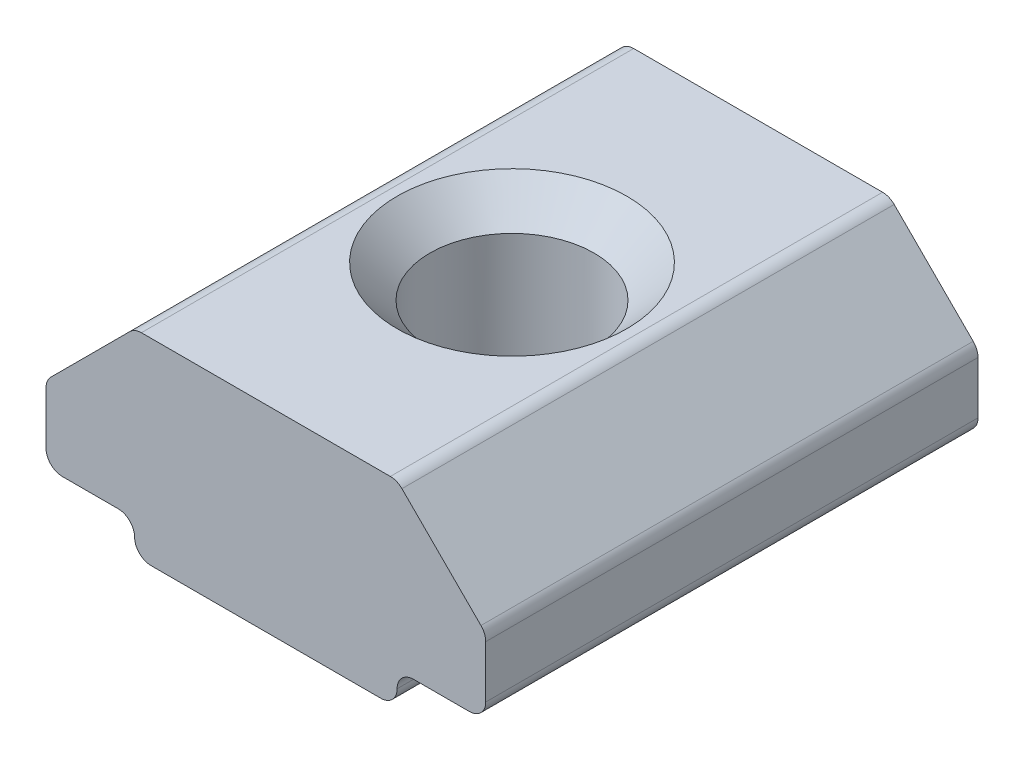
ISO-10303-21;
HEADER;
FILE_DESCRIPTION(('STEP AP214'),'2;1');
FILE_NAME('part.step','',(''),(''),'','','');
FILE_SCHEMA(('AUTOMOTIVE_DESIGN { 1 0 10303 214 1 1 1 1 }'));
ENDSEC;
DATA;
#1=APPLICATION_CONTEXT('core data for automotive mechanical design processes');
#2=APPLICATION_PROTOCOL_DEFINITION('international standard','automotive_design',2000,#1);
#3=PRODUCT_CONTEXT('',#1,'mechanical');
#4=PRODUCT('Part','Part','',(#3));
#5=PRODUCT_RELATED_PRODUCT_CATEGORY('part','',(#4));
#6=PRODUCT_DEFINITION_FORMATION('','',#4);
#7=PRODUCT_DEFINITION_CONTEXT('part definition',#1,'design');
#8=PRODUCT_DEFINITION('design','',#6,#7);
#9=PRODUCT_DEFINITION_SHAPE('','',#8);
#10=(LENGTH_UNIT() NAMED_UNIT(*) SI_UNIT(.MILLI.,.METRE.));
#11=(NAMED_UNIT(*) PLANE_ANGLE_UNIT() SI_UNIT($,.RADIAN.));
#12=(NAMED_UNIT(*) SI_UNIT($,.STERADIAN.) SOLID_ANGLE_UNIT());
#13=UNCERTAINTY_MEASURE_WITH_UNIT(LENGTH_MEASURE(1.E-05),#10,'distance_accuracy_value','');
#14=(GEOMETRIC_REPRESENTATION_CONTEXT(3) GLOBAL_UNCERTAINTY_ASSIGNED_CONTEXT((#13)) GLOBAL_UNIT_ASSIGNED_CONTEXT((#10,
#11,#12)) REPRESENTATION_CONTEXT('',''));
#15=CARTESIAN_POINT('',(0.,0.,0.));
#16=DIRECTION('',(0.,0.,1.));
#17=DIRECTION('',(1.,0.,0.));
#18=AXIS2_PLACEMENT_3D('',#15,#16,#17);
#19=CARTESIAN_POINT('',(-4.,0.,15.));
#20=DIRECTION('',(0.,1.,0.));
#21=DIRECTION('',(0.,0.,1.));
#22=AXIS2_PLACEMENT_3D('',#19,#20,#21);
#23=PLANE('',#22);
#24=DIRECTION('',(1.,0.,0.));
#25=VECTOR('',#24,1.);
#26=CARTESIAN_POINT('',(-4.,0.,0.));
#27=LINE('',#26,#25);
#28=CARTESIAN_POINT('',(-3.5,0.,0.));
#29=VERTEX_POINT('',#28);
#30=CARTESIAN_POINT('',(3.5,0.,0.));
#31=VERTEX_POINT('',#30);
#32=EDGE_CURVE('E268',#29,#31,#27,.T.);
#33=ORIENTED_EDGE('',*,*,#32,.T.);
#34=DIRECTION('',(0.,0.,-1.));
#35=VECTOR('',#34,1.);
#36=CARTESIAN_POINT('',(3.5,0.,15.));
#37=LINE('',#36,#35);
#38=CARTESIAN_POINT('',(3.5,0.,7.5));
#39=VERTEX_POINT('',#38);
#40=EDGE_CURVE('E253',#31,#39,#37,.F.);
#41=ORIENTED_EDGE('',*,*,#40,.T.);
#42=CARTESIAN_POINT('',(0.,0.,7.5));
#43=DIRECTION('',(0.,1.,0.));
#44=DIRECTION('',(0.,0.,1.));
#45=AXIS2_PLACEMENT_3D('',#42,#43,#44);
#46=CIRCLE('',#45,3.5);
#47=CARTESIAN_POINT('',(-3.5,0.,7.5));
#48=VERTEX_POINT('',#47);
#49=EDGE_CURVE('E230',#39,#48,#46,.T.);
#50=ORIENTED_EDGE('',*,*,#49,.T.);
#51=DIRECTION('',(0.,0.,-1.));
#52=VECTOR('',#51,1.);
#53=CARTESIAN_POINT('',(-3.5,0.,15.));
#54=LINE('',#53,#52);
#55=EDGE_CURVE('E246',#48,#29,#54,.T.);
#56=ORIENTED_EDGE('',*,*,#55,.T.);
#57=EDGE_LOOP('',(#33,#41,#50,#56));
#58=FACE_BOUND('',#57,.T.);
#59=ADVANCED_FACE('F16',(#58),#23,.F.);
#60=EDGE_CURVE('E229',#48,#39,#46,.T.);
#61=ORIENTED_EDGE('',*,*,#60,.T.);
#62=DIRECTION('',(0.,0.,-1.));
#63=VECTOR('',#62,1.);
#64=CARTESIAN_POINT('',(3.5,0.,15.));
#65=LINE('',#64,#63);
#66=CARTESIAN_POINT('',(3.5,0.,15.));
#67=VERTEX_POINT('',#66);
#68=EDGE_CURVE('E251',#39,#67,#65,.F.);
#69=ORIENTED_EDGE('',*,*,#68,.T.);
#70=DIRECTION('',(1.,0.,0.));
#71=VECTOR('',#70,1.);
#72=CARTESIAN_POINT('',(-4.,0.,15.));
#73=LINE('',#72,#71);
#74=CARTESIAN_POINT('',(-3.5,0.,15.));
#75=VERTEX_POINT('',#74);
#76=EDGE_CURVE('E173',#75,#67,#73,.T.);
#77=ORIENTED_EDGE('',*,*,#76,.F.);
#78=DIRECTION('',(0.,0.,-1.));
#79=VECTOR('',#78,1.);
#80=CARTESIAN_POINT('',(-3.5,0.,15.));
#81=LINE('',#80,#79);
#82=EDGE_CURVE('E248',#75,#48,#81,.T.);
#83=ORIENTED_EDGE('',*,*,#82,.T.);
#84=EDGE_LOOP('',(#61,#69,#77,#83));
#85=FACE_BOUND('',#84,.T.);
#86=ADVANCED_FACE('F327',(#85),#23,.F.);
#87=CARTESIAN_POINT('',(4.,1.,15.));
#88=DIRECTION('',(0.,1.,0.));
#89=DIRECTION('',(0.,0.,1.));
#90=AXIS2_PLACEMENT_3D('',#87,#88,#89);
#91=PLANE('',#90);
#92=DIRECTION('',(1.,0.,0.));
#93=VECTOR('',#92,1.);
#94=CARTESIAN_POINT('',(4.,1.,15.));
#95=LINE('',#94,#93);
#96=CARTESIAN_POINT('',(4.5,1.,15.));
#97=VERTEX_POINT('',#96);
#98=CARTESIAN_POINT('',(6.2,1.,15.));
#99=VERTEX_POINT('',#98);
#100=EDGE_CURVE('E176',#97,#99,#95,.T.);
#101=ORIENTED_EDGE('',*,*,#100,.F.);
#102=DIRECTION('',(0.,0.,-1.));
#103=VECTOR('',#102,1.);
#104=CARTESIAN_POINT('',(4.5,1.,0.));
#105=LINE('',#104,#103);
#106=CARTESIAN_POINT('',(4.5,1.,0.));
#107=VERTEX_POINT('',#106);
#108=EDGE_CURVE('E259',#97,#107,#105,.T.);
#109=ORIENTED_EDGE('',*,*,#108,.T.);
#110=DIRECTION('',(1.,0.,0.));
#111=VECTOR('',#110,1.);
#112=CARTESIAN_POINT('',(4.,1.,0.));
#113=LINE('',#112,#111);
#114=CARTESIAN_POINT('',(6.2,1.,0.));
#115=VERTEX_POINT('',#114);
#116=EDGE_CURVE('E273',#107,#115,#113,.T.);
#117=ORIENTED_EDGE('',*,*,#116,.T.);
#118=DIRECTION('',(0.,0.,-1.));
#119=VECTOR('',#118,1.);
#120=CARTESIAN_POINT('',(6.2,1.,15.));
#121=LINE('',#120,#119);
#122=EDGE_CURVE('E226',#115,#99,#121,.F.);
#123=ORIENTED_EDGE('',*,*,#122,.T.);
#124=EDGE_LOOP('',(#101,#109,#117,#123));
#125=FACE_BOUND('',#124,.T.);
#126=ADVANCED_FACE('F333',(#125),#91,.F.);
#127=CARTESIAN_POINT('',(6.7,1.,15.));
#128=DIRECTION('',(-1.,0.,0.));
#129=DIRECTION('',(0.,0.,1.));
#130=AXIS2_PLACEMENT_3D('',#127,#128,#129);
#131=PLANE('',#130);
#132=DIRECTION('',(0.,1.,0.));
#133=VECTOR('',#132,1.);
#134=CARTESIAN_POINT('',(6.7,1.,0.));
#135=LINE('',#134,#133);
#136=CARTESIAN_POINT('',(6.7,1.5,0.));
#137=VERTEX_POINT('',#136);
#138=CARTESIAN_POINT('',(6.7,3.09289321881346,0.));
#139=VERTEX_POINT('',#138);
#140=EDGE_CURVE('E293',#137,#139,#135,.T.);
#141=ORIENTED_EDGE('',*,*,#140,.T.);
#142=DIRECTION('',(0.,0.,-1.));
#143=VECTOR('',#142,1.);
#144=CARTESIAN_POINT('',(6.7,3.09289321881346,15.));
#145=LINE('',#144,#143);
#146=CARTESIAN_POINT('',(6.7,3.09289321881346,15.));
#147=VERTEX_POINT('',#146);
#148=EDGE_CURVE('E224',#139,#147,#145,.F.);
#149=ORIENTED_EDGE('',*,*,#148,.T.);
#150=DIRECTION('',(0.,1.,0.));
#151=VECTOR('',#150,1.);
#152=CARTESIAN_POINT('',(6.7,1.,15.));
#153=LINE('',#152,#151);
#154=CARTESIAN_POINT('',(6.7,1.5,15.));
#155=VERTEX_POINT('',#154);
#156=EDGE_CURVE('E547',#155,#147,#153,.T.);
#157=ORIENTED_EDGE('',*,*,#156,.F.);
#158=DIRECTION('',(0.,0.,-1.));
#159=VECTOR('',#158,1.);
#160=CARTESIAN_POINT('',(6.7,1.5,15.));
#161=LINE('',#160,#159);
#162=EDGE_CURVE('E221',#155,#137,#161,.T.);
#163=ORIENTED_EDGE('',*,*,#162,.T.);
#164=EDGE_LOOP('',(#141,#149,#157,#163));
#165=FACE_BOUND('',#164,.T.);
#166=ADVANCED_FACE('F492',(#165),#131,.F.);
#167=CARTESIAN_POINT('',(6.7,3.30000000000001,15.));
#168=DIRECTION('',(-0.707106781186546,-0.707106781186549,0.));
#169=DIRECTION('',(0.707106781186549,-0.707106781186546,0.));
#170=AXIS2_PLACEMENT_3D('',#167,#168,#169);
#171=PLANE('',#170);
#172=DIRECTION('',(-0.707106781186549,0.707106781186546,0.));
#173=VECTOR('',#172,1.);
#174=CARTESIAN_POINT('',(6.7,3.30000000000001,0.));
#175=LINE('',#174,#173);
#176=CARTESIAN_POINT('',(6.55355339059327,3.44644660940674,0.));
#177=VERTEX_POINT('',#176);
#178=CARTESIAN_POINT('',(4.14644660940672,5.85355339059327,0.));
#179=VERTEX_POINT('',#178);
#180=EDGE_CURVE('E296',#177,#179,#175,.T.);
#181=ORIENTED_EDGE('',*,*,#180,.T.);
#182=DIRECTION('',(0.,0.,-1.));
#183=VECTOR('',#182,1.);
#184=CARTESIAN_POINT('',(4.14644660940672,5.85355339059327,15.));
#185=LINE('',#184,#183);
#186=CARTESIAN_POINT('',(4.14644660940672,5.85355339059327,15.));
#187=VERTEX_POINT('',#186);
#188=EDGE_CURVE('E219',#179,#187,#185,.F.);
#189=ORIENTED_EDGE('',*,*,#188,.T.);
#190=DIRECTION('',(-0.707106781186549,0.707106781186546,0.));
#191=VECTOR('',#190,1.);
#192=CARTESIAN_POINT('',(6.7,3.30000000000001,15.));
#193=LINE('',#192,#191);
#194=CARTESIAN_POINT('',(6.55355339059327,3.44644660940674,15.));
#195=VERTEX_POINT('',#194);
#196=EDGE_CURVE('E557',#195,#187,#193,.T.);
#197=ORIENTED_EDGE('',*,*,#196,.F.);
#198=DIRECTION('',(0.,0.,-1.));
#199=VECTOR('',#198,1.);
#200=CARTESIAN_POINT('',(6.55355339059327,3.44644660940674,15.));
#201=LINE('',#200,#199);
#202=EDGE_CURVE('E216',#195,#177,#201,.T.);
#203=ORIENTED_EDGE('',*,*,#202,.T.);
#204=EDGE_LOOP('',(#181,#189,#197,#203));
#205=FACE_BOUND('',#204,.T.);
#206=ADVANCED_FACE('F482',(#205),#171,.F.);
#207=CARTESIAN_POINT('',(4.,6.,15.));
#208=DIRECTION('',(0.,-1.,0.));
#209=DIRECTION('',(0.,0.,-1.));
#210=AXIS2_PLACEMENT_3D('',#207,#208,#209);
#211=PLANE('',#210);
#212=CARTESIAN_POINT('',(0.,6.,7.5));
#213=DIRECTION('',(0.,-1.,0.));
#214=DIRECTION('',(0.,0.,-1.));
#215=AXIS2_PLACEMENT_3D('',#212,#213,#214);
#216=CIRCLE('',#215,3.50000000000001);
#217=CARTESIAN_POINT('',(0.,6.,3.99999999999999));
#218=VERTEX_POINT('',#217);
#219=EDGE_CURVE('E239',#218,#218,#216,.T.);
#220=ORIENTED_EDGE('',*,*,#219,.T.);
#221=EDGE_LOOP('',(#220));
#222=FACE_BOUND('',#221,.T.);
#223=DIRECTION('',(-1.,0.,0.));
#224=VECTOR('',#223,1.);
#225=CARTESIAN_POINT('',(4.,6.,0.));
#226=LINE('',#225,#224);
#227=CARTESIAN_POINT('',(3.79289321881345,6.,0.));
#228=VERTEX_POINT('',#227);
#229=CARTESIAN_POINT('',(-3.79289321881345,6.,0.));
#230=VERTEX_POINT('',#229);
#231=EDGE_CURVE('E299',#228,#230,#226,.T.);
#232=ORIENTED_EDGE('',*,*,#231,.T.);
#233=DIRECTION('',(0.,0.,-1.));
#234=VECTOR('',#233,1.);
#235=CARTESIAN_POINT('',(-3.79289321881345,6.,15.));
#236=LINE('',#235,#234);
#237=CARTESIAN_POINT('',(-3.79289321881345,6.,15.));
#238=VERTEX_POINT('',#237);
#239=EDGE_CURVE('E214',#230,#238,#236,.F.);
#240=ORIENTED_EDGE('',*,*,#239,.T.);
#241=DIRECTION('',(-1.,0.,0.));
#242=VECTOR('',#241,1.);
#243=CARTESIAN_POINT('',(4.,6.,15.));
#244=LINE('',#243,#242);
#245=CARTESIAN_POINT('',(3.79289321881345,6.,15.));
#246=VERTEX_POINT('',#245);
#247=EDGE_CURVE('E560',#246,#238,#244,.T.);
#248=ORIENTED_EDGE('',*,*,#247,.F.);
#249=DIRECTION('',(0.,0.,-1.));
#250=VECTOR('',#249,1.);
#251=CARTESIAN_POINT('',(3.79289321881345,6.,15.));
#252=LINE('',#251,#250);
#253=EDGE_CURVE('E211',#246,#228,#252,.T.);
#254=ORIENTED_EDGE('',*,*,#253,.T.);
#255=EDGE_LOOP('',(#232,#240,#248,#254));
#256=FACE_BOUND('',#255,.T.);
#257=ADVANCED_FACE('F324',(#222,#256),#211,.F.);
#258=CARTESIAN_POINT('',(-6.7,3.30000000000001,15.));
#259=DIRECTION('',(0.707106781186546,-0.707106781186549,0.));
#260=DIRECTION('',(0.707106781186549,0.707106781186546,0.));
#261=AXIS2_PLACEMENT_3D('',#258,#259,#260);
#262=PLANE('',#261);
#263=DIRECTION('',(-0.707106781186549,-0.707106781186546,0.));
#264=VECTOR('',#263,1.);
#265=CARTESIAN_POINT('',(-6.7,3.30000000000001,0.));
#266=LINE('',#265,#264);
#267=CARTESIAN_POINT('',(-4.14644660940673,5.85355339059327,0.));
#268=VERTEX_POINT('',#267);
#269=CARTESIAN_POINT('',(-6.55355339059327,3.44644660940673,0.));
#270=VERTEX_POINT('',#269);
#271=EDGE_CURVE('E178',#268,#270,#266,.T.);
#272=ORIENTED_EDGE('',*,*,#271,.T.);
#273=DIRECTION('',(0.,0.,-1.));
#274=VECTOR('',#273,1.);
#275=CARTESIAN_POINT('',(-6.55355339059327,3.44644660940673,15.));
#276=LINE('',#275,#274);
#277=CARTESIAN_POINT('',(-6.55355339059327,3.44644660940673,15.));
#278=VERTEX_POINT('',#277);
#279=EDGE_CURVE('E209',#270,#278,#276,.F.);
#280=ORIENTED_EDGE('',*,*,#279,.T.);
#281=DIRECTION('',(-0.707106781186549,-0.707106781186546,0.));
#282=VECTOR('',#281,1.);
#283=CARTESIAN_POINT('',(-6.7,3.30000000000001,15.));
#284=LINE('',#283,#282);
#285=CARTESIAN_POINT('',(-4.14644660940673,5.85355339059327,15.));
#286=VERTEX_POINT('',#285);
#287=EDGE_CURVE('E288',#286,#278,#284,.T.);
#288=ORIENTED_EDGE('',*,*,#287,.F.);
#289=DIRECTION('',(0.,0.,-1.));
#290=VECTOR('',#289,1.);
#291=CARTESIAN_POINT('',(-4.14644660940673,5.85355339059327,15.));
#292=LINE('',#291,#290);
#293=EDGE_CURVE('E206',#286,#268,#292,.T.);
#294=ORIENTED_EDGE('',*,*,#293,.T.);
#295=EDGE_LOOP('',(#272,#280,#288,#294));
#296=FACE_BOUND('',#295,.T.);
#297=ADVANCED_FACE('F305',(#296),#262,.F.);
#298=CARTESIAN_POINT('',(-6.7,1.,15.));
#299=DIRECTION('',(1.,0.,0.));
#300=DIRECTION('',(0.,0.,-1.));
#301=AXIS2_PLACEMENT_3D('',#298,#299,#300);
#302=PLANE('',#301);
#303=DIRECTION('',(0.,-1.,0.));
#304=VECTOR('',#303,1.);
#305=CARTESIAN_POINT('',(-6.7,1.,0.));
#306=LINE('',#305,#304);
#307=CARTESIAN_POINT('',(-6.7,3.09289321881346,0.));
#308=VERTEX_POINT('',#307);
#309=CARTESIAN_POINT('',(-6.7,1.5,0.));
#310=VERTEX_POINT('',#309);
#311=EDGE_CURVE('E174',#308,#310,#306,.T.);
#312=ORIENTED_EDGE('',*,*,#311,.T.);
#313=DIRECTION('',(0.,0.,-1.));
#314=VECTOR('',#313,1.);
#315=CARTESIAN_POINT('',(-6.7,1.5,15.));
#316=LINE('',#315,#314);
#317=CARTESIAN_POINT('',(-6.7,1.5,15.));
#318=VERTEX_POINT('',#317);
#319=EDGE_CURVE('E152',#310,#318,#316,.F.);
#320=ORIENTED_EDGE('',*,*,#319,.T.);
#321=DIRECTION('',(0.,-1.,0.));
#322=VECTOR('',#321,1.);
#323=CARTESIAN_POINT('',(-6.7,1.,15.));
#324=LINE('',#323,#322);
#325=CARTESIAN_POINT('',(-6.7,3.09289321881346,15.));
#326=VERTEX_POINT('',#325);
#327=EDGE_CURVE('E286',#326,#318,#324,.T.);
#328=ORIENTED_EDGE('',*,*,#327,.F.);
#329=DIRECTION('',(0.,0.,-1.));
#330=VECTOR('',#329,1.);
#331=CARTESIAN_POINT('',(-6.7,3.09289321881346,15.));
#332=LINE('',#331,#330);
#333=EDGE_CURVE('E157',#326,#308,#332,.T.);
#334=ORIENTED_EDGE('',*,*,#333,.T.);
#335=EDGE_LOOP('',(#312,#320,#328,#334));
#336=FACE_BOUND('',#335,.T.);
#337=ADVANCED_FACE('F315',(#336),#302,.F.);
#338=CARTESIAN_POINT('',(-6.7,1.,15.));
#339=DIRECTION('',(0.,1.,0.));
#340=DIRECTION('',(0.,0.,1.));
#341=AXIS2_PLACEMENT_3D('',#338,#339,#340);
#342=PLANE('',#341);
#343=DIRECTION('',(1.,0.,0.));
#344=VECTOR('',#343,1.);
#345=CARTESIAN_POINT('',(-6.7,1.,0.));
#346=LINE('',#345,#344);
#347=CARTESIAN_POINT('',(-6.2,1.,0.));
#348=VERTEX_POINT('',#347);
#349=CARTESIAN_POINT('',(-4.5,1.,0.));
#350=VERTEX_POINT('',#349);
#351=EDGE_CURVE('E164',#348,#350,#346,.T.);
#352=ORIENTED_EDGE('',*,*,#351,.T.);
#353=DIRECTION('',(0.,0.,-1.));
#354=VECTOR('',#353,1.);
#355=CARTESIAN_POINT('',(-4.5,1.,15.));
#356=LINE('',#355,#354);
#357=CARTESIAN_POINT('',(-4.5,1.,15.));
#358=VERTEX_POINT('',#357);
#359=EDGE_CURVE('E261',#350,#358,#356,.F.);
#360=ORIENTED_EDGE('',*,*,#359,.T.);
#361=DIRECTION('',(1.,0.,0.));
#362=VECTOR('',#361,1.);
#363=CARTESIAN_POINT('',(-6.7,1.,15.));
#364=LINE('',#363,#362);
#365=CARTESIAN_POINT('',(-6.2,1.,15.));
#366=VERTEX_POINT('',#365);
#367=EDGE_CURVE('E167',#366,#358,#364,.T.);
#368=ORIENTED_EDGE('',*,*,#367,.F.);
#369=DIRECTION('',(0.,0.,-1.));
#370=VECTOR('',#369,1.);
#371=CARTESIAN_POINT('',(-6.2,1.,15.));
#372=LINE('',#371,#370);
#373=EDGE_CURVE('E151',#366,#348,#372,.T.);
#374=ORIENTED_EDGE('',*,*,#373,.T.);
#375=EDGE_LOOP('',(#352,#360,#368,#374));
#376=FACE_BOUND('',#375,.T.);
#377=ADVANCED_FACE('F163',(#376),#342,.F.);
#378=CARTESIAN_POINT('',(0.,0.,15.));
#379=DIRECTION('',(0.,0.,1.));
#380=DIRECTION('',(1.,0.,0.));
#381=AXIS2_PLACEMENT_3D('',#378,#379,#380);
#382=PLANE('',#381);
#383=ORIENTED_EDGE('',*,*,#76,.T.);
#384=CARTESIAN_POINT('',(3.5,0.5,15.));
#385=DIRECTION('',(0.,0.,1.));
#386=DIRECTION('',(1.,0.,0.));
#387=AXIS2_PLACEMENT_3D('',#384,#385,#386);
#388=CIRCLE('',#387,0.5);
#389=CARTESIAN_POINT('',(4.,0.5,15.));
#390=VERTEX_POINT('',#389);
#391=EDGE_CURVE('E38',#67,#390,#388,.T.);
#392=ORIENTED_EDGE('',*,*,#391,.T.);
#393=CARTESIAN_POINT('',(4.5,0.5,15.));
#394=DIRECTION('',(0.,0.,1.));
#395=DIRECTION('',(1.,0.,0.));
#396=AXIS2_PLACEMENT_3D('',#393,#394,#395);
#397=CIRCLE('',#396,0.5);
#398=EDGE_CURVE('E33',#390,#97,#397,.F.);
#399=ORIENTED_EDGE('',*,*,#398,.T.);
#400=ORIENTED_EDGE('',*,*,#100,.T.);
#401=CARTESIAN_POINT('',(6.2,1.5,15.));
#402=DIRECTION('',(0.,0.,1.));
#403=DIRECTION('',(1.,0.,0.));
#404=AXIS2_PLACEMENT_3D('',#401,#402,#403);
#405=CIRCLE('',#404,0.5);
#406=EDGE_CURVE('E194',#99,#155,#405,.T.);
#407=ORIENTED_EDGE('',*,*,#406,.T.);
#408=ORIENTED_EDGE('',*,*,#156,.T.);
#409=CARTESIAN_POINT('',(6.2,3.09289321881346,15.));
#410=DIRECTION('',(0.,0.,1.));
#411=DIRECTION('',(1.,0.,0.));
#412=AXIS2_PLACEMENT_3D('',#409,#410,#411);
#413=CIRCLE('',#412,0.5);
#414=EDGE_CURVE('E196',#147,#195,#413,.T.);
#415=ORIENTED_EDGE('',*,*,#414,.T.);
#416=ORIENTED_EDGE('',*,*,#196,.T.);
#417=CARTESIAN_POINT('',(3.79289321881345,5.5,15.));
#418=DIRECTION('',(0.,0.,1.));
#419=DIRECTION('',(1.,0.,0.));
#420=AXIS2_PLACEMENT_3D('',#417,#418,#419);
#421=CIRCLE('',#420,0.5);
#422=EDGE_CURVE('E198',#187,#246,#421,.T.);
#423=ORIENTED_EDGE('',*,*,#422,.T.);
#424=ORIENTED_EDGE('',*,*,#247,.T.);
#425=CARTESIAN_POINT('',(-3.79289321881345,5.5,15.));
#426=DIRECTION('',(0.,0.,1.));
#427=DIRECTION('',(1.,0.,0.));
#428=AXIS2_PLACEMENT_3D('',#425,#426,#427);
#429=CIRCLE('',#428,0.5);
#430=EDGE_CURVE('E200',#238,#286,#429,.T.);
#431=ORIENTED_EDGE('',*,*,#430,.T.);
#432=ORIENTED_EDGE('',*,*,#287,.T.);
#433=CARTESIAN_POINT('',(-6.2,3.09289321881346,15.));
#434=DIRECTION('',(0.,0.,1.));
#435=DIRECTION('',(1.,0.,0.));
#436=AXIS2_PLACEMENT_3D('',#433,#434,#435);
#437=CIRCLE('',#436,0.5);
#438=EDGE_CURVE('E202',#278,#326,#437,.T.);
#439=ORIENTED_EDGE('',*,*,#438,.T.);
#440=ORIENTED_EDGE('',*,*,#327,.T.);
#441=CARTESIAN_POINT('',(-6.2,1.5,15.));
#442=DIRECTION('',(0.,0.,1.));
#443=DIRECTION('',(1.,0.,0.));
#444=AXIS2_PLACEMENT_3D('',#441,#442,#443);
#445=CIRCLE('',#444,0.5);
#446=EDGE_CURVE('E204',#318,#366,#445,.T.);
#447=ORIENTED_EDGE('',*,*,#446,.T.);
#448=ORIENTED_EDGE('',*,*,#367,.T.);
#449=CARTESIAN_POINT('',(-4.5,0.5,15.));
#450=DIRECTION('',(0.,0.,1.));
#451=DIRECTION('',(1.,0.,0.));
#452=AXIS2_PLACEMENT_3D('',#449,#450,#451);
#453=CIRCLE('',#452,0.5);
#454=CARTESIAN_POINT('',(-4.,0.5,15.));
#455=VERTEX_POINT('',#454);
#456=EDGE_CURVE('E10',#358,#455,#453,.F.);
#457=ORIENTED_EDGE('',*,*,#456,.T.);
#458=CARTESIAN_POINT('',(-3.5,0.5,15.));
#459=DIRECTION('',(0.,0.,1.));
#460=DIRECTION('',(1.,0.,0.));
#461=AXIS2_PLACEMENT_3D('',#458,#459,#460);
#462=CIRCLE('',#461,0.5);
#463=EDGE_CURVE('E256',#455,#75,#462,.T.);
#464=ORIENTED_EDGE('',*,*,#463,.T.);
#465=EDGE_LOOP('',(#383,#392,#399,#400,#407,#408,#415,#416,#423,#424,#431,#432,#439,#440,#447,
#448,#457,#464));
#466=FACE_BOUND('',#465,.T.);
#467=ADVANCED_FACE('F284',(#466),#382,.T.);
#468=CARTESIAN_POINT('',(0.,0.,0.));
#469=DIRECTION('',(0.,0.,1.));
#470=DIRECTION('',(1.,0.,0.));
#471=AXIS2_PLACEMENT_3D('',#468,#469,#470);
#472=PLANE('',#471);
#473=ORIENTED_EDGE('',*,*,#116,.F.);
#474=CARTESIAN_POINT('',(4.5,0.5,0.));
#475=DIRECTION('',(0.,0.,1.));
#476=DIRECTION('',(1.,0.,0.));
#477=AXIS2_PLACEMENT_3D('',#474,#475,#476);
#478=CIRCLE('',#477,0.5);
#479=CARTESIAN_POINT('',(4.,0.5,0.));
#480=VERTEX_POINT('',#479);
#481=EDGE_CURVE('E263',#107,#480,#478,.T.);
#482=ORIENTED_EDGE('',*,*,#481,.T.);
#483=CARTESIAN_POINT('',(3.5,0.5,0.));
#484=DIRECTION('',(0.,0.,1.));
#485=DIRECTION('',(1.,0.,0.));
#486=AXIS2_PLACEMENT_3D('',#483,#484,#485);
#487=CIRCLE('',#486,0.5);
#488=EDGE_CURVE('E244',#480,#31,#487,.F.);
#489=ORIENTED_EDGE('',*,*,#488,.T.);
#490=ORIENTED_EDGE('',*,*,#32,.F.);
#491=CARTESIAN_POINT('',(-3.5,0.5,0.));
#492=DIRECTION('',(0.,0.,1.));
#493=DIRECTION('',(1.,0.,0.));
#494=AXIS2_PLACEMENT_3D('',#491,#492,#493);
#495=CIRCLE('',#494,0.5);
#496=CARTESIAN_POINT('',(-4.,0.5,0.));
#497=VERTEX_POINT('',#496);
#498=EDGE_CURVE('E242',#29,#497,#495,.F.);
#499=ORIENTED_EDGE('',*,*,#498,.T.);
#500=CARTESIAN_POINT('',(-4.5,0.5,0.));
#501=DIRECTION('',(0.,0.,1.));
#502=DIRECTION('',(1.,0.,0.));
#503=AXIS2_PLACEMENT_3D('',#500,#501,#502);
#504=CIRCLE('',#503,0.5);
#505=EDGE_CURVE('E25',#497,#350,#504,.T.);
#506=ORIENTED_EDGE('',*,*,#505,.T.);
#507=ORIENTED_EDGE('',*,*,#351,.F.);
#508=CARTESIAN_POINT('',(-6.2,1.5,0.));
#509=DIRECTION('',(0.,0.,1.));
#510=DIRECTION('',(1.,0.,0.));
#511=AXIS2_PLACEMENT_3D('',#508,#509,#510);
#512=CIRCLE('',#511,0.5);
#513=EDGE_CURVE('E147',#348,#310,#512,.F.);
#514=ORIENTED_EDGE('',*,*,#513,.T.);
#515=ORIENTED_EDGE('',*,*,#311,.F.);
#516=CARTESIAN_POINT('',(-6.2,3.09289321881346,0.));
#517=DIRECTION('',(0.,0.,1.));
#518=DIRECTION('',(1.,0.,0.));
#519=AXIS2_PLACEMENT_3D('',#516,#517,#518);
#520=CIRCLE('',#519,0.5);
#521=EDGE_CURVE('E158',#308,#270,#520,.F.);
#522=ORIENTED_EDGE('',*,*,#521,.T.);
#523=ORIENTED_EDGE('',*,*,#271,.F.);
#524=CARTESIAN_POINT('',(-3.79289321881345,5.5,0.));
#525=DIRECTION('',(0.,0.,1.));
#526=DIRECTION('',(1.,0.,0.));
#527=AXIS2_PLACEMENT_3D('',#524,#525,#526);
#528=CIRCLE('',#527,0.5);
#529=EDGE_CURVE('E188',#268,#230,#528,.F.);
#530=ORIENTED_EDGE('',*,*,#529,.T.);
#531=ORIENTED_EDGE('',*,*,#231,.F.);
#532=CARTESIAN_POINT('',(3.79289321881345,5.5,0.));
#533=DIRECTION('',(0.,0.,1.));
#534=DIRECTION('',(1.,0.,0.));
#535=AXIS2_PLACEMENT_3D('',#532,#533,#534);
#536=CIRCLE('',#535,0.5);
#537=EDGE_CURVE('E186',#228,#179,#536,.F.);
#538=ORIENTED_EDGE('',*,*,#537,.T.);
#539=ORIENTED_EDGE('',*,*,#180,.F.);
#540=CARTESIAN_POINT('',(6.2,3.09289321881346,0.));
#541=DIRECTION('',(0.,0.,1.));
#542=DIRECTION('',(1.,0.,0.));
#543=AXIS2_PLACEMENT_3D('',#540,#541,#542);
#544=CIRCLE('',#543,0.5);
#545=EDGE_CURVE('E184',#177,#139,#544,.F.);
#546=ORIENTED_EDGE('',*,*,#545,.T.);
#547=ORIENTED_EDGE('',*,*,#140,.F.);
#548=CARTESIAN_POINT('',(6.2,1.5,0.));
#549=DIRECTION('',(0.,0.,1.));
#550=DIRECTION('',(1.,0.,0.));
#551=AXIS2_PLACEMENT_3D('',#548,#549,#550);
#552=CIRCLE('',#551,0.5);
#553=EDGE_CURVE('E168',#137,#115,#552,.F.);
#554=ORIENTED_EDGE('',*,*,#553,.T.);
#555=EDGE_LOOP('',(#473,#482,#489,#490,#499,#506,#507,#514,#515,#522,#523,#530,#531,#538,#539,
#546,#547,#554));
#556=FACE_BOUND('',#555,.T.);
#557=ADVANCED_FACE('F171',(#556),#472,.F.);
#558=CARTESIAN_POINT('',(-6.2,1.5,15.));
#559=DIRECTION('',(0.,0.,-1.));
#560=DIRECTION('',(-1.,0.,0.));
#561=AXIS2_PLACEMENT_3D('',#558,#559,#560);
#562=CYLINDRICAL_SURFACE('',#561,0.5);
#563=ORIENTED_EDGE('',*,*,#446,.F.);
#564=ORIENTED_EDGE('',*,*,#319,.F.);
#565=ORIENTED_EDGE('',*,*,#513,.F.);
#566=ORIENTED_EDGE('',*,*,#373,.F.);
#567=EDGE_LOOP('',(#563,#564,#565,#566));
#568=FACE_BOUND('',#567,.T.);
#569=ADVANCED_FACE('F150',(#568),#562,.T.);
#570=CARTESIAN_POINT('',(-6.2,3.09289321881346,15.));
#571=DIRECTION('',(0.,0.,-1.));
#572=DIRECTION('',(-1.,0.,0.));
#573=AXIS2_PLACEMENT_3D('',#570,#571,#572);
#574=CYLINDRICAL_SURFACE('',#573,0.5);
#575=ORIENTED_EDGE('',*,*,#438,.F.);
#576=ORIENTED_EDGE('',*,*,#279,.F.);
#577=ORIENTED_EDGE('',*,*,#521,.F.);
#578=ORIENTED_EDGE('',*,*,#333,.F.);
#579=EDGE_LOOP('',(#575,#576,#577,#578));
#580=FACE_BOUND('',#579,.T.);
#581=ADVANCED_FACE('F311',(#580),#574,.T.);
#582=CARTESIAN_POINT('',(-3.79289321881345,5.5,15.));
#583=DIRECTION('',(0.,0.,-1.));
#584=DIRECTION('',(-1.,0.,0.));
#585=AXIS2_PLACEMENT_3D('',#582,#583,#584);
#586=CYLINDRICAL_SURFACE('',#585,0.5);
#587=ORIENTED_EDGE('',*,*,#430,.F.);
#588=ORIENTED_EDGE('',*,*,#239,.F.);
#589=ORIENTED_EDGE('',*,*,#529,.F.);
#590=ORIENTED_EDGE('',*,*,#293,.F.);
#591=EDGE_LOOP('',(#587,#588,#589,#590));
#592=FACE_BOUND('',#591,.T.);
#593=ADVANCED_FACE('F342',(#592),#586,.T.);
#594=CARTESIAN_POINT('',(3.79289321881345,5.5,15.));
#595=DIRECTION('',(0.,0.,-1.));
#596=DIRECTION('',(-1.,0.,0.));
#597=AXIS2_PLACEMENT_3D('',#594,#595,#596);
#598=CYLINDRICAL_SURFACE('',#597,0.5);
#599=ORIENTED_EDGE('',*,*,#422,.F.);
#600=ORIENTED_EDGE('',*,*,#188,.F.);
#601=ORIENTED_EDGE('',*,*,#537,.F.);
#602=ORIENTED_EDGE('',*,*,#253,.F.);
#603=EDGE_LOOP('',(#599,#600,#601,#602));
#604=FACE_BOUND('',#603,.T.);
#605=ADVANCED_FACE('F345',(#604),#598,.T.);
#606=CARTESIAN_POINT('',(6.2,3.09289321881346,15.));
#607=DIRECTION('',(0.,0.,-1.));
#608=DIRECTION('',(-1.,0.,0.));
#609=AXIS2_PLACEMENT_3D('',#606,#607,#608);
#610=CYLINDRICAL_SURFACE('',#609,0.5);
#611=ORIENTED_EDGE('',*,*,#414,.F.);
#612=ORIENTED_EDGE('',*,*,#148,.F.);
#613=ORIENTED_EDGE('',*,*,#545,.F.);
#614=ORIENTED_EDGE('',*,*,#202,.F.);
#615=EDGE_LOOP('',(#611,#612,#613,#614));
#616=FACE_BOUND('',#615,.T.);
#617=ADVANCED_FACE('F349',(#616),#610,.T.);
#618=CARTESIAN_POINT('',(6.2,1.5,15.));
#619=DIRECTION('',(0.,0.,-1.));
#620=DIRECTION('',(-1.,0.,0.));
#621=AXIS2_PLACEMENT_3D('',#618,#619,#620);
#622=CYLINDRICAL_SURFACE('',#621,0.5);
#623=ORIENTED_EDGE('',*,*,#406,.F.);
#624=ORIENTED_EDGE('',*,*,#122,.F.);
#625=ORIENTED_EDGE('',*,*,#553,.F.);
#626=ORIENTED_EDGE('',*,*,#162,.F.);
#627=EDGE_LOOP('',(#623,#624,#625,#626));
#628=FACE_BOUND('',#627,.T.);
#629=ADVANCED_FACE('F353',(#628),#622,.T.);
#630=CARTESIAN_POINT('',(0.,0.,7.5));
#631=DIRECTION('',(0.,1.,0.));
#632=DIRECTION('',(0.,0.,1.));
#633=AXIS2_PLACEMENT_3D('',#630,#631,#632);
#634=CYLINDRICAL_SURFACE('',#633,2.5);
#635=CARTESIAN_POINT('',(0.,1.,7.5));
#636=DIRECTION('',(0.,1.,0.));
#637=DIRECTION('',(0.,0.,1.));
#638=AXIS2_PLACEMENT_3D('',#635,#636,#637);
#639=CIRCLE('',#638,2.5);
#640=CARTESIAN_POINT('',(0.,1.,10.));
#641=VERTEX_POINT('',#640);
#642=EDGE_CURVE('E236',#641,#641,#639,.F.);
#643=ORIENTED_EDGE('',*,*,#642,.T.);
#644=EDGE_LOOP('',(#643));
#645=FACE_BOUND('',#644,.T.);
#646=CARTESIAN_POINT('',(0.,5.,7.5));
#647=DIRECTION('',(0.,-1.,0.));
#648=DIRECTION('',(0.,0.,-1.));
#649=AXIS2_PLACEMENT_3D('',#646,#647,#648);
#650=CIRCLE('',#649,2.5);
#651=CARTESIAN_POINT('',(0.,5.,5.));
#652=VERTEX_POINT('',#651);
#653=EDGE_CURVE('E233',#652,#652,#650,.F.);
#654=ORIENTED_EDGE('',*,*,#653,.T.);
#655=EDGE_LOOP('',(#654));
#656=FACE_BOUND('',#655,.T.);
#657=ADVANCED_FACE('F357',(#645,#656),#634,.F.);
#658=CARTESIAN_POINT('',(0.,0.,7.5));
#659=DIRECTION('',(0.,-1.,0.));
#660=DIRECTION('',(0.,0.,-1.));
#661=AXIS2_PLACEMENT_3D('',#658,#659,#660);
#662=CONICAL_SURFACE('',#661,3.5,0.785398163397447);
#663=ORIENTED_EDGE('',*,*,#642,.F.);
#664=EDGE_LOOP('',(#663));
#665=FACE_BOUND('',#664,.T.);
#666=ORIENTED_EDGE('',*,*,#49,.F.);
#667=ORIENTED_EDGE('',*,*,#60,.F.);
#668=EDGE_LOOP('',(#666,#667));
#669=FACE_BOUND('',#668,.T.);
#670=ADVANCED_FACE('F359',(#665,#669),#662,.F.);
#671=CARTESIAN_POINT('',(0.,5.,7.5));
#672=DIRECTION('',(0.,1.,0.));
#673=DIRECTION('',(0.,0.,1.));
#674=AXIS2_PLACEMENT_3D('',#671,#672,#673);
#675=CONICAL_SURFACE('',#674,2.5,0.785398163397452);
#676=ORIENTED_EDGE('',*,*,#219,.F.);
#677=EDGE_LOOP('',(#676));
#678=FACE_BOUND('',#677,.T.);
#679=ORIENTED_EDGE('',*,*,#653,.F.);
#680=EDGE_LOOP('',(#679));
#681=FACE_BOUND('',#680,.T.);
#682=ADVANCED_FACE('F362',(#678,#681),#675,.F.);
#683=CARTESIAN_POINT('',(4.5,0.5,15.));
#684=DIRECTION('',(0.,0.,1.));
#685=DIRECTION('',(1.,0.,0.));
#686=AXIS2_PLACEMENT_3D('',#683,#684,#685);
#687=CYLINDRICAL_SURFACE('',#686,0.5);
#688=ORIENTED_EDGE('',*,*,#108,.F.);
#689=ORIENTED_EDGE('',*,*,#398,.F.);
#690=DIRECTION('',(0.,0.,-1.));
#691=VECTOR('',#690,1.);
#692=CARTESIAN_POINT('',(4.,0.5,15.));
#693=LINE('',#692,#691);
#694=EDGE_CURVE('E266',#480,#390,#693,.F.);
#695=ORIENTED_EDGE('',*,*,#694,.F.);
#696=ORIENTED_EDGE('',*,*,#481,.F.);
#697=EDGE_LOOP('',(#688,#689,#695,#696));
#698=FACE_BOUND('',#697,.T.);
#699=ADVANCED_FACE('F366',(#698),#687,.F.);
#700=CARTESIAN_POINT('',(3.5,0.5,15.));
#701=DIRECTION('',(0.,0.,-1.));
#702=DIRECTION('',(-1.,0.,0.));
#703=AXIS2_PLACEMENT_3D('',#700,#701,#702);
#704=CYLINDRICAL_SURFACE('',#703,0.5);
#705=ORIENTED_EDGE('',*,*,#68,.F.);
#706=ORIENTED_EDGE('',*,*,#40,.F.);
#707=ORIENTED_EDGE('',*,*,#488,.F.);
#708=ORIENTED_EDGE('',*,*,#694,.T.);
#709=ORIENTED_EDGE('',*,*,#391,.F.);
#710=EDGE_LOOP('',(#705,#706,#707,#708,#709));
#711=FACE_BOUND('',#710,.T.);
#712=ADVANCED_FACE('F368',(#711),#704,.T.);
#713=CARTESIAN_POINT('',(-4.5,0.5,15.));
#714=DIRECTION('',(0.,0.,1.));
#715=DIRECTION('',(1.,0.,0.));
#716=AXIS2_PLACEMENT_3D('',#713,#714,#715);
#717=CYLINDRICAL_SURFACE('',#716,0.5);
#718=DIRECTION('',(0.,0.,-1.));
#719=VECTOR('',#718,1.);
#720=CARTESIAN_POINT('',(-4.,0.5,0.));
#721=LINE('',#720,#719);
#722=EDGE_CURVE('E20',#455,#497,#721,.T.);
#723=ORIENTED_EDGE('',*,*,#722,.F.);
#724=ORIENTED_EDGE('',*,*,#456,.F.);
#725=ORIENTED_EDGE('',*,*,#359,.F.);
#726=ORIENTED_EDGE('',*,*,#505,.F.);
#727=EDGE_LOOP('',(#723,#724,#725,#726));
#728=FACE_BOUND('',#727,.T.);
#729=ADVANCED_FACE('F18',(#728),#717,.F.);
#730=CARTESIAN_POINT('',(-3.5,0.5,15.));
#731=DIRECTION('',(0.,0.,-1.));
#732=DIRECTION('',(-1.,0.,0.));
#733=AXIS2_PLACEMENT_3D('',#730,#731,#732);
#734=CYLINDRICAL_SURFACE('',#733,0.5);
#735=ORIENTED_EDGE('',*,*,#463,.F.);
#736=ORIENTED_EDGE('',*,*,#722,.T.);
#737=ORIENTED_EDGE('',*,*,#498,.F.);
#738=ORIENTED_EDGE('',*,*,#55,.F.);
#739=ORIENTED_EDGE('',*,*,#82,.F.);
#740=EDGE_LOOP('',(#735,#736,#737,#738,#739));
#741=FACE_BOUND('',#740,.T.);
#742=ADVANCED_FACE('F280',(#741),#734,.T.);
#743=CLOSED_SHELL('',(#59,#86,#126,#166,#206,#257,#297,#337,#377,#467,#557,#569,#581,#593,#605,
#617,#629,#657,#670,#682,#699,#712,#729,#742));
#744=MANIFOLD_SOLID_BREP('B1',#743);
#745=ADVANCED_BREP_SHAPE_REPRESENTATION('',(#18,#744),#14);
#746=SHAPE_DEFINITION_REPRESENTATION(#9,#745);
ENDSEC;
END-ISO-10303-21;
